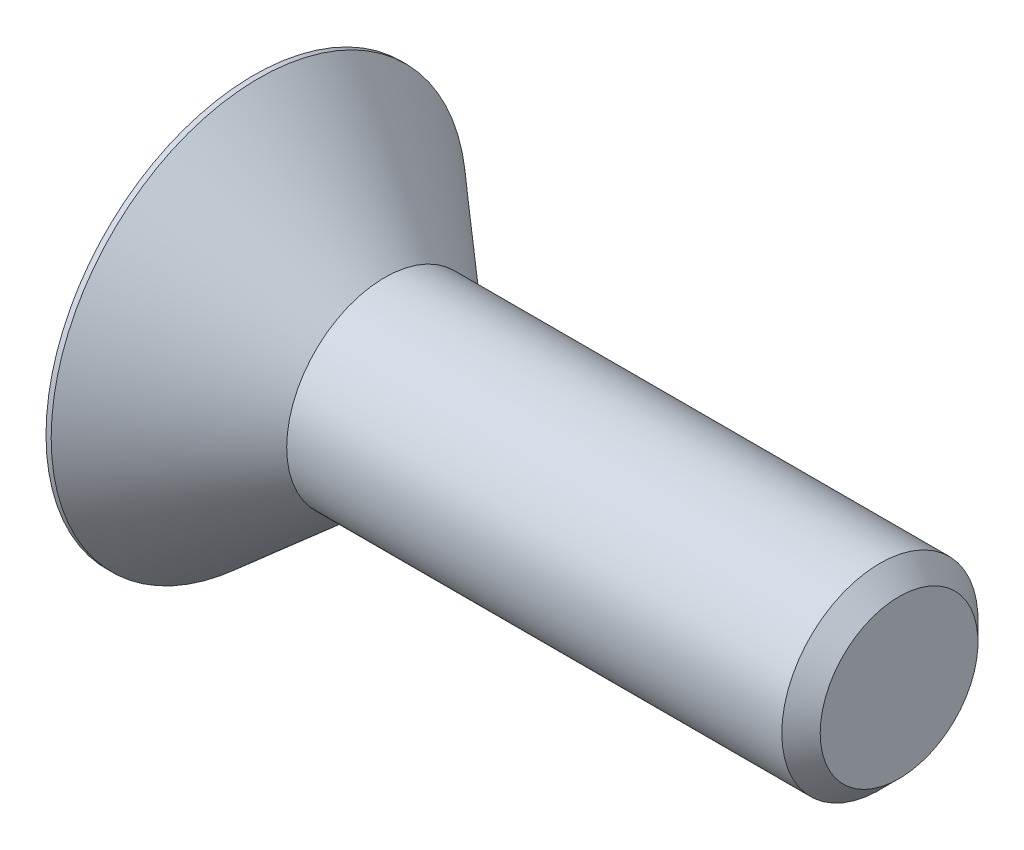
ISO-10303-21;
HEADER;
FILE_DESCRIPTION(('STEP AP214'),'2;1');
FILE_NAME('part.step','',(''),(''),'','','');
FILE_SCHEMA(('AUTOMOTIVE_DESIGN { 1 0 10303 214 1 1 1 1 }'));
ENDSEC;
DATA;
#1=APPLICATION_CONTEXT('core data for automotive mechanical design processes');
#2=APPLICATION_PROTOCOL_DEFINITION('international standard','automotive_design',2000,#1);
#3=PRODUCT_CONTEXT('',#1,'mechanical');
#4=PRODUCT('Part','Part','',(#3));
#5=PRODUCT_RELATED_PRODUCT_CATEGORY('part','',(#4));
#6=PRODUCT_DEFINITION_FORMATION('','',#4);
#7=PRODUCT_DEFINITION_CONTEXT('part definition',#1,'design');
#8=PRODUCT_DEFINITION('design','',#6,#7);
#9=PRODUCT_DEFINITION_SHAPE('','',#8);
#10=(LENGTH_UNIT() NAMED_UNIT(*) SI_UNIT(.MILLI.,.METRE.));
#11=(NAMED_UNIT(*) PLANE_ANGLE_UNIT() SI_UNIT($,.RADIAN.));
#12=(NAMED_UNIT(*) SI_UNIT($,.STERADIAN.) SOLID_ANGLE_UNIT());
#13=UNCERTAINTY_MEASURE_WITH_UNIT(LENGTH_MEASURE(1.E-05),#10,'distance_accuracy_value','');
#14=(GEOMETRIC_REPRESENTATION_CONTEXT(3) GLOBAL_UNCERTAINTY_ASSIGNED_CONTEXT((#13)) GLOBAL_UNIT_ASSIGNED_CONTEXT((#10,
#11,#12)) REPRESENTATION_CONTEXT('',''));
#15=CARTESIAN_POINT('',(0.,0.,0.));
#16=DIRECTION('',(0.,0.,1.));
#17=DIRECTION('',(1.,0.,0.));
#18=AXIS2_PLACEMENT_3D('',#15,#16,#17);
#19=CARTESIAN_POINT('',(2.20980000000282,0.,0.));
#20=DIRECTION('',(-1.,0.,0.));
#21=DIRECTION('',(0.,0.,1.));
#22=AXIS2_PLACEMENT_3D('',#19,#20,#21);
#23=CONICAL_SURFACE('',#22,1.58749999997099,1.04719755118793);
#24=CARTESIAN_POINT('',(3.12634355233854,0.,-5.6843418860808E-11));
#25=VERTEX_POINT('',#24);
#26=VERTEX_LOOP('',#25);
#27=FACE_BOUND('',#26,.T.);
#28=CARTESIAN_POINT('',(2.20980000000282,0.,0.));
#29=DIRECTION('',(-1.,0.,0.));
#30=DIRECTION('',(0.,0.,1.));
#31=AXIS2_PLACEMENT_3D('',#28,#29,#30);
#32=CIRCLE('',#31,1.58749999997099);
#33=CARTESIAN_POINT('',(2.2098000000014,0.,-1.58749999998549));
#34=VERTEX_POINT('',#33);
#35=CARTESIAN_POINT('',(2.2098000000014,1.37481532849523,-0.793749999992743));
#36=VERTEX_POINT('',#35);
#37=EDGE_CURVE('E19',#34,#36,#32,.F.);
#38=ORIENTED_EDGE('',*,*,#37,.F.);
#39=CARTESIAN_POINT('',(2.20980000000282,0.,0.));
#40=DIRECTION('',(-1.,0.,0.));
#41=DIRECTION('',(0.,0.,1.));
#42=AXIS2_PLACEMENT_3D('',#39,#40,#41);
#43=CIRCLE('',#42,1.58749999997099);
#44=CARTESIAN_POINT('',(2.2098000000014,-1.37481532849523,-0.793749999992754));
#45=VERTEX_POINT('',#44);
#46=EDGE_CURVE('E87',#45,#34,#43,.F.);
#47=ORIENTED_EDGE('',*,*,#46,.F.);
#48=CARTESIAN_POINT('',(2.20980000000282,0.,0.));
#49=DIRECTION('',(-1.,0.,0.));
#50=DIRECTION('',(0.,0.,1.));
#51=AXIS2_PLACEMENT_3D('',#48,#49,#50);
#52=CIRCLE('',#51,1.58749999997099);
#53=CARTESIAN_POINT('',(2.2098000000014,-1.37481532849523,0.793749999992755));
#54=VERTEX_POINT('',#53);
#55=EDGE_CURVE('E105',#54,#45,#52,.F.);
#56=ORIENTED_EDGE('',*,*,#55,.F.);
#57=CARTESIAN_POINT('',(2.20980000000282,0.,0.));
#58=DIRECTION('',(-1.,0.,0.));
#59=DIRECTION('',(0.,0.,1.));
#60=AXIS2_PLACEMENT_3D('',#57,#58,#59);
#61=CIRCLE('',#60,1.58749999997099);
#62=CARTESIAN_POINT('',(2.2098000000014,0.,1.5874999999855));
#63=VERTEX_POINT('',#62);
#64=EDGE_CURVE('E104',#63,#54,#61,.F.);
#65=ORIENTED_EDGE('',*,*,#64,.F.);
#66=CARTESIAN_POINT('',(2.20980000000282,0.,0.));
#67=DIRECTION('',(-1.,0.,0.));
#68=DIRECTION('',(0.,0.,1.));
#69=AXIS2_PLACEMENT_3D('',#66,#67,#68);
#70=CIRCLE('',#69,1.58749999997099);
#71=CARTESIAN_POINT('',(2.2098000000014,1.37481532849524,0.793749999992742));
#72=VERTEX_POINT('',#71);
#73=EDGE_CURVE('E167',#72,#63,#70,.F.);
#74=ORIENTED_EDGE('',*,*,#73,.F.);
#75=CARTESIAN_POINT('',(2.20980000000282,0.,0.));
#76=DIRECTION('',(-1.,0.,0.));
#77=DIRECTION('',(0.,0.,1.));
#78=AXIS2_PLACEMENT_3D('',#75,#76,#77);
#79=CIRCLE('',#78,1.58749999997099);
#80=EDGE_CURVE('E90',#36,#72,#79,.F.);
#81=ORIENTED_EDGE('',*,*,#80,.F.);
#82=EDGE_LOOP('',(#38,#47,#56,#65,#74,#81));
#83=FACE_BOUND('',#82,.T.);
#84=ADVANCED_FACE('F16',(#27,#83),#23,.F.);
#85=CARTESIAN_POINT('',(2.20979999999998,-1.83308710467707,0.));
#86=DIRECTION('',(-1.,0.,0.));
#87=DIRECTION('',(0.,0.,1.));
#88=AXIS2_PLACEMENT_3D('',#85,#86,#87);
#89=PLANE('',#88);
#90=DIRECTION('',(0.,-0.500000000000001,0.866025403784438));
#91=VECTOR('',#90,1.);
#92=CARTESIAN_POINT('',(2.20979999999998,-1.83308710467706,0.));
#93=LINE('',#92,#91);
#94=CARTESIAN_POINT('',(2.20979999999998,-1.83308710467706,0.));
#95=VERTEX_POINT('',#94);
#96=EDGE_CURVE('E128',#95,#45,#93,.F.);
#97=ORIENTED_EDGE('',*,*,#96,.F.);
#98=DIRECTION('',(0.,0.500000000000002,0.866025403784438));
#99=VECTOR('',#98,1.);
#100=CARTESIAN_POINT('',(2.20979999999998,-0.916543552338528,1.58750000000001));
#101=LINE('',#100,#99);
#102=EDGE_CURVE('E144',#54,#95,#101,.F.);
#103=ORIENTED_EDGE('',*,*,#102,.F.);
#104=ORIENTED_EDGE('',*,*,#55,.T.);
#105=EDGE_LOOP('',(#97,#103,#104));
#106=FACE_BOUND('',#105,.T.);
#107=ADVANCED_FACE('F263',(#106),#89,.T.);
#108=CARTESIAN_POINT('',(2.20979999999998,-1.83308710467707,0.));
#109=DIRECTION('',(-1.,0.,0.));
#110=DIRECTION('',(0.,0.,1.));
#111=AXIS2_PLACEMENT_3D('',#108,#109,#110);
#112=PLANE('',#111);
#113=DIRECTION('',(0.,-1.,0.));
#114=VECTOR('',#113,1.);
#115=CARTESIAN_POINT('',(2.20979999999998,-0.916543552338531,-1.58749999999999));
#116=LINE('',#115,#114);
#117=CARTESIAN_POINT('',(2.20979999999998,-0.916543552338532,-1.58749999999999));
#118=VERTEX_POINT('',#117);
#119=EDGE_CURVE('E100',#118,#34,#116,.F.);
#120=ORIENTED_EDGE('',*,*,#119,.F.);
#121=DIRECTION('',(0.,-0.500000000000001,0.866025403784438));
#122=VECTOR('',#121,1.);
#123=CARTESIAN_POINT('',(2.20979999999998,-1.83308710467706,0.));
#124=LINE('',#123,#122);
#125=EDGE_CURVE('E102',#45,#118,#124,.F.);
#126=ORIENTED_EDGE('',*,*,#125,.F.);
#127=ORIENTED_EDGE('',*,*,#46,.T.);
#128=EDGE_LOOP('',(#120,#126,#127));
#129=FACE_BOUND('',#128,.T.);
#130=ADVANCED_FACE('F98',(#129),#112,.T.);
#131=CARTESIAN_POINT('',(2.20979999999998,-1.83308710467707,0.));
#132=DIRECTION('',(-1.,0.,0.));
#133=DIRECTION('',(0.,0.,1.));
#134=AXIS2_PLACEMENT_3D('',#131,#132,#133);
#135=PLANE('',#134);
#136=DIRECTION('',(0.,-0.5,-0.866025403784439));
#137=VECTOR('',#136,1.);
#138=CARTESIAN_POINT('',(2.20979999999998,0.916543552338531,-1.58749999999999));
#139=LINE('',#138,#137);
#140=CARTESIAN_POINT('',(2.20979999999998,0.916543552338531,-1.58749999999999));
#141=VERTEX_POINT('',#140);
#142=EDGE_CURVE('E109',#141,#36,#139,.F.);
#143=ORIENTED_EDGE('',*,*,#142,.F.);
#144=DIRECTION('',(0.,-1.,0.));
#145=VECTOR('',#144,1.);
#146=CARTESIAN_POINT('',(2.20979999999998,-0.916543552338531,-1.58749999999999));
#147=LINE('',#146,#145);
#148=EDGE_CURVE('E107',#34,#141,#147,.F.);
#149=ORIENTED_EDGE('',*,*,#148,.F.);
#150=ORIENTED_EDGE('',*,*,#37,.T.);
#151=EDGE_LOOP('',(#143,#149,#150));
#152=FACE_BOUND('',#151,.T.);
#153=ADVANCED_FACE('F108',(#152),#135,.T.);
#154=CARTESIAN_POINT('',(2.20979999999998,-1.83308710467707,0.));
#155=DIRECTION('',(-1.,0.,0.));
#156=DIRECTION('',(0.,0.,1.));
#157=AXIS2_PLACEMENT_3D('',#154,#155,#156);
#158=PLANE('',#157);
#159=DIRECTION('',(0.,0.499999999999999,-0.866025403784439));
#160=VECTOR('',#159,1.);
#161=CARTESIAN_POINT('',(2.20979999999998,1.83308710467706,0.));
#162=LINE('',#161,#160);
#163=CARTESIAN_POINT('',(2.20979999999998,1.83308710467706,0.));
#164=VERTEX_POINT('',#163);
#165=EDGE_CURVE('E173',#164,#72,#162,.F.);
#166=ORIENTED_EDGE('',*,*,#165,.F.);
#167=DIRECTION('',(0.,-0.5,-0.866025403784439));
#168=VECTOR('',#167,1.);
#169=CARTESIAN_POINT('',(2.20979999999998,0.916543552338531,-1.58749999999999));
#170=LINE('',#169,#168);
#171=EDGE_CURVE('E175',#36,#164,#170,.F.);
#172=ORIENTED_EDGE('',*,*,#171,.F.);
#173=ORIENTED_EDGE('',*,*,#80,.T.);
#174=EDGE_LOOP('',(#166,#172,#173));
#175=FACE_BOUND('',#174,.T.);
#176=ADVANCED_FACE('F172',(#175),#158,.T.);
#177=CARTESIAN_POINT('',(2.20979999999998,-1.83308710467707,0.));
#178=DIRECTION('',(-1.,0.,0.));
#179=DIRECTION('',(0.,0.,1.));
#180=AXIS2_PLACEMENT_3D('',#177,#178,#179);
#181=PLANE('',#180);
#182=DIRECTION('',(0.,1.,0.));
#183=VECTOR('',#182,1.);
#184=CARTESIAN_POINT('',(2.20979999999998,0.916543552338531,1.58750000000001));
#185=LINE('',#184,#183);
#186=CARTESIAN_POINT('',(2.20979999999998,0.91654355233853,1.58750000000001));
#187=VERTEX_POINT('',#186);
#188=EDGE_CURVE('E186',#187,#63,#185,.F.);
#189=ORIENTED_EDGE('',*,*,#188,.F.);
#190=DIRECTION('',(0.,0.499999999999999,-0.866025403784439));
#191=VECTOR('',#190,1.);
#192=CARTESIAN_POINT('',(2.20979999999998,1.83308710467706,0.));
#193=LINE('',#192,#191);
#194=EDGE_CURVE('E178',#72,#187,#193,.F.);
#195=ORIENTED_EDGE('',*,*,#194,.F.);
#196=ORIENTED_EDGE('',*,*,#73,.T.);
#197=EDGE_LOOP('',(#189,#195,#196));
#198=FACE_BOUND('',#197,.T.);
#199=ADVANCED_FACE('F183',(#198),#181,.T.);
#200=CARTESIAN_POINT('',(2.20979999999998,-1.83308710467707,0.));
#201=DIRECTION('',(-1.,0.,0.));
#202=DIRECTION('',(0.,0.,1.));
#203=AXIS2_PLACEMENT_3D('',#200,#201,#202);
#204=PLANE('',#203);
#205=DIRECTION('',(0.,0.500000000000002,0.866025403784438));
#206=VECTOR('',#205,1.);
#207=CARTESIAN_POINT('',(2.20979999999998,-0.916543552338528,1.58750000000001));
#208=LINE('',#207,#206);
#209=CARTESIAN_POINT('',(2.20979999999998,-0.916543552338528,1.58750000000001));
#210=VERTEX_POINT('',#209);
#211=EDGE_CURVE('E148',#210,#54,#208,.F.);
#212=ORIENTED_EDGE('',*,*,#211,.F.);
#213=DIRECTION('',(0.,1.,0.));
#214=VECTOR('',#213,1.);
#215=CARTESIAN_POINT('',(2.20979999999998,0.916543552338531,1.58750000000001));
#216=LINE('',#215,#214);
#217=EDGE_CURVE('E192',#63,#210,#216,.F.);
#218=ORIENTED_EDGE('',*,*,#217,.F.);
#219=ORIENTED_EDGE('',*,*,#64,.T.);
#220=EDGE_LOOP('',(#212,#218,#219));
#221=FACE_BOUND('',#220,.T.);
#222=ADVANCED_FACE('F193',(#221),#204,.T.);
#223=CARTESIAN_POINT('',(2.20979999999998,-0.916543552338528,1.58750000000001));
#224=DIRECTION('',(0.,0.866025403784438,-0.500000000000002));
#225=DIRECTION('',(0.,0.500000000000002,0.866025403784438));
#226=AXIS2_PLACEMENT_3D('',#223,#224,#225);
#227=PLANE('',#226);
#228=ORIENTED_EDGE('',*,*,#102,.T.);
#229=DIRECTION('',(1.,0.,0.));
#230=VECTOR('',#229,1.);
#231=CARTESIAN_POINT('',(2.20979999999998,-1.83308710467706,0.));
#232=LINE('',#231,#230);
#233=CARTESIAN_POINT('',(0.,-1.83308710467706,0.));
#234=VERTEX_POINT('',#233);
#235=EDGE_CURVE('E139',#234,#95,#232,.T.);
#236=ORIENTED_EDGE('',*,*,#235,.F.);
#237=DIRECTION('',(0.,-0.5,-0.866025403784438));
#238=VECTOR('',#237,1.);
#239=CARTESIAN_POINT('',(0.,-0.916543552338528,1.58750000000001));
#240=LINE('',#239,#238);
#241=CARTESIAN_POINT('',(0.,-0.916543552338528,1.58750000000001));
#242=VERTEX_POINT('',#241);
#243=EDGE_CURVE('E135',#242,#234,#240,.T.);
#244=ORIENTED_EDGE('',*,*,#243,.F.);
#245=DIRECTION('',(1.,0.,0.));
#246=VECTOR('',#245,1.);
#247=CARTESIAN_POINT('',(2.20979999999998,-0.916543552338528,1.58750000000001));
#248=LINE('',#247,#246);
#249=EDGE_CURVE('E153',#210,#242,#248,.F.);
#250=ORIENTED_EDGE('',*,*,#249,.F.);
#251=ORIENTED_EDGE('',*,*,#211,.T.);
#252=EDGE_LOOP('',(#228,#236,#244,#250,#251));
#253=FACE_BOUND('',#252,.T.);
#254=ADVANCED_FACE('F258',(#253),#227,.T.);
#255=CARTESIAN_POINT('',(2.20979999999998,-1.83308710467706,0.));
#256=DIRECTION('',(0.,0.866025403784438,0.500000000000001));
#257=DIRECTION('',(0.,-0.500000000000001,0.866025403784438));
#258=AXIS2_PLACEMENT_3D('',#255,#256,#257);
#259=PLANE('',#258);
#260=ORIENTED_EDGE('',*,*,#125,.T.);
#261=DIRECTION('',(1.,0.,0.));
#262=VECTOR('',#261,1.);
#263=CARTESIAN_POINT('',(2.20979999999998,-0.916543552338531,-1.58749999999999));
#264=LINE('',#263,#262);
#265=CARTESIAN_POINT('',(0.,-0.916543552338532,-1.58749999999999));
#266=VERTEX_POINT('',#265);
#267=EDGE_CURVE('E116',#266,#118,#264,.T.);
#268=ORIENTED_EDGE('',*,*,#267,.F.);
#269=DIRECTION('',(0.,0.500000000000002,-0.866025403784437));
#270=VECTOR('',#269,1.);
#271=CARTESIAN_POINT('',(0.,-1.83308710467706,0.));
#272=LINE('',#271,#270);
#273=EDGE_CURVE('E131',#234,#266,#272,.T.);
#274=ORIENTED_EDGE('',*,*,#273,.F.);
#275=ORIENTED_EDGE('',*,*,#235,.T.);
#276=ORIENTED_EDGE('',*,*,#96,.T.);
#277=EDGE_LOOP('',(#260,#268,#274,#275,#276));
#278=FACE_BOUND('',#277,.T.);
#279=ADVANCED_FACE('F261',(#278),#259,.T.);
#280=CARTESIAN_POINT('',(2.20979999999998,-0.916543552338531,-1.58749999999999));
#281=DIRECTION('',(0.,0.,1.));
#282=DIRECTION('',(0.,-1.,0.));
#283=AXIS2_PLACEMENT_3D('',#280,#281,#282);
#284=PLANE('',#283);
#285=ORIENTED_EDGE('',*,*,#148,.T.);
#286=DIRECTION('',(1.,0.,0.));
#287=VECTOR('',#286,1.);
#288=CARTESIAN_POINT('',(2.20979999999998,0.916543552338531,-1.58749999999999));
#289=LINE('',#288,#287);
#290=CARTESIAN_POINT('',(0.,0.916543552338531,-1.58749999999999));
#291=VERTEX_POINT('',#290);
#292=EDGE_CURVE('E112',#291,#141,#289,.T.);
#293=ORIENTED_EDGE('',*,*,#292,.F.);
#294=DIRECTION('',(0.,1.,0.));
#295=VECTOR('',#294,1.);
#296=CARTESIAN_POINT('',(0.,0.,-1.58749999999999));
#297=LINE('',#296,#295);
#298=EDGE_CURVE('E134',#266,#291,#297,.T.);
#299=ORIENTED_EDGE('',*,*,#298,.F.);
#300=ORIENTED_EDGE('',*,*,#267,.T.);
#301=ORIENTED_EDGE('',*,*,#119,.T.);
#302=EDGE_LOOP('',(#285,#293,#299,#300,#301));
#303=FACE_BOUND('',#302,.T.);
#304=ADVANCED_FACE('F114',(#303),#284,.T.);
#305=CARTESIAN_POINT('',(2.20979999999998,0.916543552338531,-1.58749999999999));
#306=DIRECTION('',(0.,-0.866025403784439,0.5));
#307=DIRECTION('',(0.,-0.5,-0.866025403784439));
#308=AXIS2_PLACEMENT_3D('',#305,#306,#307);
#309=PLANE('',#308);
#310=ORIENTED_EDGE('',*,*,#171,.T.);
#311=DIRECTION('',(1.,0.,0.));
#312=VECTOR('',#311,1.);
#313=CARTESIAN_POINT('',(2.20979999999998,1.83308710467706,0.));
#314=LINE('',#313,#312);
#315=CARTESIAN_POINT('',(0.,1.83308710467706,0.));
#316=VERTEX_POINT('',#315);
#317=EDGE_CURVE('E180',#316,#164,#314,.T.);
#318=ORIENTED_EDGE('',*,*,#317,.F.);
#319=DIRECTION('',(0.,0.500000000000001,0.866025403784438));
#320=VECTOR('',#319,1.);
#321=CARTESIAN_POINT('',(0.,0.916543552338531,-1.58749999999999));
#322=LINE('',#321,#320);
#323=EDGE_CURVE('E226',#291,#316,#322,.T.);
#324=ORIENTED_EDGE('',*,*,#323,.F.);
#325=ORIENTED_EDGE('',*,*,#292,.T.);
#326=ORIENTED_EDGE('',*,*,#142,.T.);
#327=EDGE_LOOP('',(#310,#318,#324,#325,#326));
#328=FACE_BOUND('',#327,.T.);
#329=ADVANCED_FACE('F255',(#328),#309,.T.);
#330=CARTESIAN_POINT('',(2.20979999999998,1.83308710467706,0.));
#331=DIRECTION('',(0.,-0.866025403784439,-0.499999999999999));
#332=DIRECTION('',(0.,0.499999999999999,-0.866025403784439));
#333=AXIS2_PLACEMENT_3D('',#330,#331,#332);
#334=PLANE('',#333);
#335=ORIENTED_EDGE('',*,*,#194,.T.);
#336=DIRECTION('',(1.,0.,0.));
#337=VECTOR('',#336,1.);
#338=CARTESIAN_POINT('',(2.20979999999998,0.916543552338531,1.58750000000001));
#339=LINE('',#338,#337);
#340=CARTESIAN_POINT('',(0.,0.916543552338531,1.58750000000001));
#341=VERTEX_POINT('',#340);
#342=EDGE_CURVE('E34',#341,#187,#339,.T.);
#343=ORIENTED_EDGE('',*,*,#342,.F.);
#344=DIRECTION('',(0.,-0.499999999999997,0.86602540378444));
#345=VECTOR('',#344,1.);
#346=CARTESIAN_POINT('',(0.,1.83308710467706,0.));
#347=LINE('',#346,#345);
#348=EDGE_CURVE('E221',#316,#341,#347,.T.);
#349=ORIENTED_EDGE('',*,*,#348,.F.);
#350=ORIENTED_EDGE('',*,*,#317,.T.);
#351=ORIENTED_EDGE('',*,*,#165,.T.);
#352=EDGE_LOOP('',(#335,#343,#349,#350,#351));
#353=FACE_BOUND('',#352,.T.);
#354=ADVANCED_FACE('F177',(#353),#334,.T.);
#355=CARTESIAN_POINT('',(2.20979999999998,0.916543552338531,1.58750000000001));
#356=DIRECTION('',(0.,0.,-1.));
#357=DIRECTION('',(0.,1.,0.));
#358=AXIS2_PLACEMENT_3D('',#355,#356,#357);
#359=PLANE('',#358);
#360=ORIENTED_EDGE('',*,*,#217,.T.);
#361=ORIENTED_EDGE('',*,*,#249,.T.);
#362=DIRECTION('',(0.,1.,0.));
#363=VECTOR('',#362,1.);
#364=CARTESIAN_POINT('',(0.,0.,1.58750000000001));
#365=LINE('',#364,#363);
#366=EDGE_CURVE('E163',#341,#242,#365,.F.);
#367=ORIENTED_EDGE('',*,*,#366,.F.);
#368=ORIENTED_EDGE('',*,*,#342,.T.);
#369=ORIENTED_EDGE('',*,*,#188,.T.);
#370=EDGE_LOOP('',(#360,#361,#367,#368,#369));
#371=FACE_BOUND('',#370,.T.);
#372=ADVANCED_FACE('F199',(#371),#359,.T.);
#373=CARTESIAN_POINT('',(0.,0.,0.));
#374=DIRECTION('',(-1.,0.,0.));
#375=DIRECTION('',(0.,0.,1.));
#376=AXIS2_PLACEMENT_3D('',#373,#374,#375);
#377=PLANE('',#376);
#378=ORIENTED_EDGE('',*,*,#348,.T.);
#379=ORIENTED_EDGE('',*,*,#366,.T.);
#380=ORIENTED_EDGE('',*,*,#243,.T.);
#381=ORIENTED_EDGE('',*,*,#273,.T.);
#382=ORIENTED_EDGE('',*,*,#298,.T.);
#383=ORIENTED_EDGE('',*,*,#323,.T.);
#384=EDGE_LOOP('',(#378,#379,#380,#381,#382,#383));
#385=FACE_BOUND('',#384,.T.);
#386=CARTESIAN_POINT('',(0.,0.,0.));
#387=DIRECTION('',(-1.,0.,0.));
#388=DIRECTION('',(0.,0.,1.));
#389=AXIS2_PLACEMENT_3D('',#386,#387,#388);
#390=CIRCLE('',#389,5.10667);
#391=CARTESIAN_POINT('',(0.,0.,5.10667));
#392=VERTEX_POINT('',#391);
#393=EDGE_CURVE('E160',#392,#392,#390,.F.);
#394=ORIENTED_EDGE('',*,*,#393,.F.);
#395=EDGE_LOOP('',(#394));
#396=FACE_BOUND('',#395,.T.);
#397=ADVANCED_FACE('F250',(#385,#396),#377,.T.);
#398=CARTESIAN_POINT('',(15.875,1.94056,0.));
#399=DIRECTION('',(1.,0.,0.));
#400=DIRECTION('',(0.,0.,-1.));
#401=AXIS2_PLACEMENT_3D('',#398,#399,#400);
#402=PLANE('',#401);
#403=CARTESIAN_POINT('',(15.8750000000509,0.,0.));
#404=DIRECTION('',(-1.,0.,0.));
#405=DIRECTION('',(0.,0.,1.));
#406=AXIS2_PLACEMENT_3D('',#403,#404,#405);
#407=CIRCLE('',#406,1.94055999992315);
#408=CARTESIAN_POINT('',(15.8750000000509,0.,1.94055999992315));
#409=VERTEX_POINT('',#408);
#410=EDGE_CURVE('E156',#409,#409,#407,.T.);
#411=ORIENTED_EDGE('',*,*,#410,.F.);
#412=EDGE_LOOP('',(#411));
#413=FACE_BOUND('',#412,.T.);
#414=ADVANCED_FACE('F291',(#413),#402,.T.);
#415=CARTESIAN_POINT('',(0.,0.,0.));
#416=DIRECTION('',(-1.,0.,0.));
#417=DIRECTION('',(0.,0.,1.));
#418=AXIS2_PLACEMENT_3D('',#415,#416,#417);
#419=CYLINDRICAL_SURFACE('',#418,5.10667);
#420=ORIENTED_EDGE('',*,*,#393,.T.);
#421=EDGE_LOOP('',(#420));
#422=FACE_BOUND('',#421,.T.);
#423=CARTESIAN_POINT('',(0.12700000007726,0.,0.));
#424=DIRECTION('',(-1.,0.,0.));
#425=DIRECTION('',(0.,0.,1.));
#426=AXIS2_PLACEMENT_3D('',#423,#424,#425);
#427=CIRCLE('',#426,5.10666999997511);
#428=CARTESIAN_POINT('',(0.12700000007726,0.,5.10666999997511));
#429=VERTEX_POINT('',#428);
#430=EDGE_CURVE('E159',#429,#429,#427,.F.);
#431=ORIENTED_EDGE('',*,*,#430,.F.);
#432=EDGE_LOOP('',(#431));
#433=FACE_BOUND('',#432,.T.);
#434=ADVANCED_FACE('F287',(#422,#433),#419,.T.);
#435=CARTESIAN_POINT('',(15.4025600000409,0.,0.));
#436=DIRECTION('',(-1.,0.,0.));
#437=DIRECTION('',(0.,0.,1.));
#438=AXIS2_PLACEMENT_3D('',#435,#436,#437);
#439=CONICAL_SURFACE('',#438,2.41299999993316,0.785398163397448);
#440=CARTESIAN_POINT('',(15.40256,0.,0.));
#441=DIRECTION('',(-1.,0.,0.));
#442=DIRECTION('',(0.,0.,1.));
#443=AXIS2_PLACEMENT_3D('',#440,#441,#442);
#444=CIRCLE('',#443,2.413);
#445=CARTESIAN_POINT('',(15.40256,0.,2.413));
#446=VERTEX_POINT('',#445);
#447=EDGE_CURVE('E25',#446,#446,#444,.T.);
#448=ORIENTED_EDGE('',*,*,#447,.F.);
#449=EDGE_LOOP('',(#448));
#450=FACE_BOUND('',#449,.T.);
#451=ORIENTED_EDGE('',*,*,#410,.T.);
#452=EDGE_LOOP('',(#451));
#453=FACE_BOUND('',#452,.T.);
#454=ADVANCED_FACE('F280',(#450,#453),#439,.T.);
#455=CARTESIAN_POINT('',(0.12700000024779,0.,0.));
#456=DIRECTION('',(-1.,0.,0.));
#457=DIRECTION('',(0.,0.,1.));
#458=AXIS2_PLACEMENT_3D('',#455,#456,#457);
#459=CONICAL_SURFACE('',#458,5.10666999986142,0.715584993323263);
#460=ORIENTED_EDGE('',*,*,#430,.T.);
#461=EDGE_LOOP('',(#460));
#462=FACE_BOUND('',#461,.T.);
#463=CARTESIAN_POINT('',(3.22571286747902,0.,0.));
#464=DIRECTION('',(-1.,0.,0.));
#465=DIRECTION('',(0.,0.,1.));
#466=AXIS2_PLACEMENT_3D('',#463,#464,#465);
#467=CIRCLE('',#466,2.413);
#468=CARTESIAN_POINT('',(3.22571286747902,0.,2.413));
#469=VERTEX_POINT('',#468);
#470=EDGE_CURVE('E11',#469,#469,#467,.F.);
#471=ORIENTED_EDGE('',*,*,#470,.F.);
#472=EDGE_LOOP('',(#471));
#473=FACE_BOUND('',#472,.T.);
#474=ADVANCED_FACE('F274',(#462,#473),#459,.T.);
#475=CARTESIAN_POINT('',(0.,0.,0.));
#476=DIRECTION('',(-1.,0.,0.));
#477=DIRECTION('',(0.,0.,1.));
#478=AXIS2_PLACEMENT_3D('',#475,#476,#477);
#479=CYLINDRICAL_SURFACE('',#478,2.413);
#480=ORIENTED_EDGE('',*,*,#470,.T.);
#481=EDGE_LOOP('',(#480));
#482=FACE_BOUND('',#481,.T.);
#483=ORIENTED_EDGE('',*,*,#447,.T.);
#484=EDGE_LOOP('',(#483));
#485=FACE_BOUND('',#484,.T.);
#486=ADVANCED_FACE('F272',(#482,#485),#479,.T.);
#487=CLOSED_SHELL('',(#84,#107,#130,#153,#176,#199,#222,#254,#279,#304,#329,#354,#372,#397,#414,
#434,#454,#474,#486));
#488=MANIFOLD_SOLID_BREP('B1',#487);
#489=ADVANCED_BREP_SHAPE_REPRESENTATION('',(#18,#488),#14);
#490=SHAPE_DEFINITION_REPRESENTATION(#9,#489);
ENDSEC;
END-ISO-10303-21;
